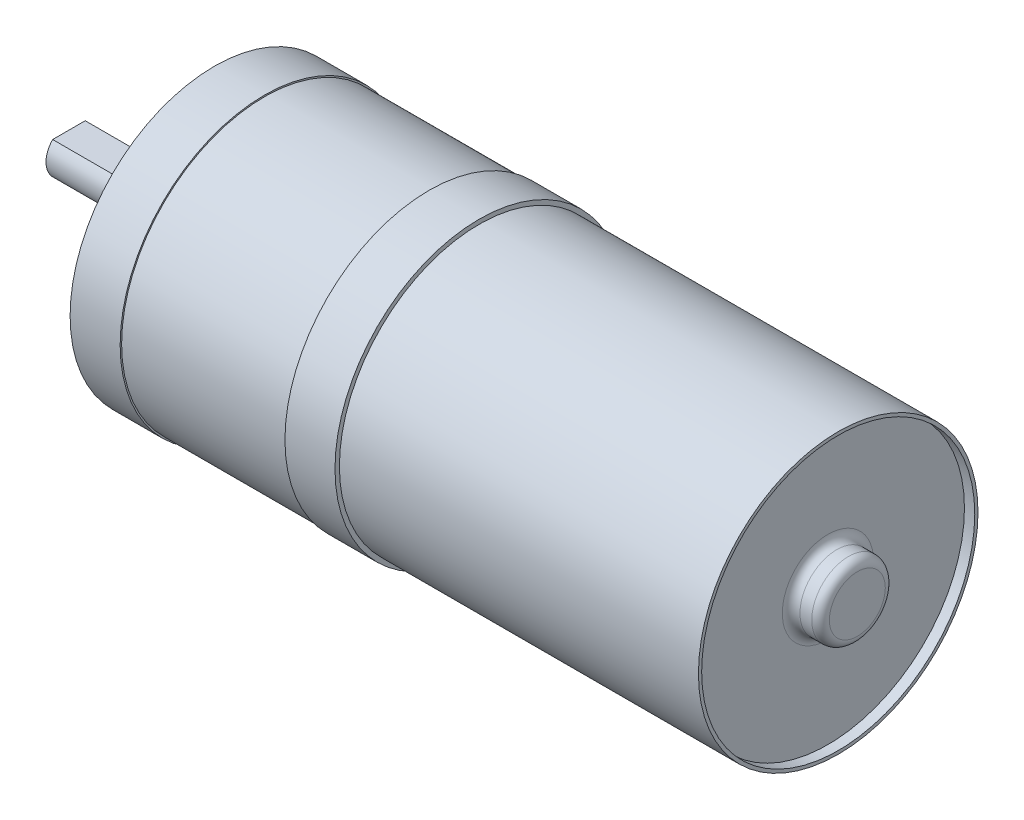
ISO-10303-21;
HEADER;
FILE_DESCRIPTION(('STEP AP214'),'2;1');
FILE_NAME('part.step','',(''),(''),'','','');
FILE_SCHEMA(('AUTOMOTIVE_DESIGN { 1 0 10303 214 1 1 1 1 }'));
ENDSEC;
DATA;
#1=APPLICATION_CONTEXT('core data for automotive mechanical design processes');
#2=APPLICATION_PROTOCOL_DEFINITION('international standard','automotive_design',2000,#1);
#3=PRODUCT_CONTEXT('',#1,'mechanical');
#4=PRODUCT('Part','Part','',(#3));
#5=PRODUCT_RELATED_PRODUCT_CATEGORY('part','',(#4));
#6=PRODUCT_DEFINITION_FORMATION('','',#4);
#7=PRODUCT_DEFINITION_CONTEXT('part definition',#1,'design');
#8=PRODUCT_DEFINITION('design','',#6,#7);
#9=PRODUCT_DEFINITION_SHAPE('','',#8);
#10=(LENGTH_UNIT() NAMED_UNIT(*) SI_UNIT(.MILLI.,.METRE.));
#11=(NAMED_UNIT(*) PLANE_ANGLE_UNIT() SI_UNIT($,.RADIAN.));
#12=(NAMED_UNIT(*) SI_UNIT($,.STERADIAN.) SOLID_ANGLE_UNIT());
#13=UNCERTAINTY_MEASURE_WITH_UNIT(LENGTH_MEASURE(1.E-05),#10,'distance_accuracy_value','');
#14=(GEOMETRIC_REPRESENTATION_CONTEXT(3) GLOBAL_UNCERTAINTY_ASSIGNED_CONTEXT((#13)) GLOBAL_UNIT_ASSIGNED_CONTEXT((#10,
#11,#12)) REPRESENTATION_CONTEXT('',''));
#15=CARTESIAN_POINT('',(0.,0.,0.));
#16=DIRECTION('',(0.,0.,1.));
#17=DIRECTION('',(1.,0.,0.));
#18=AXIS2_PLACEMENT_3D('',#15,#16,#17);
#19=CARTESIAN_POINT('',(30.099,0.,0.));
#20=DIRECTION('',(1.,0.,0.));
#21=DIRECTION('',(0.,0.,-1.));
#22=AXIS2_PLACEMENT_3D('',#19,#20,#21);
#23=PLANE('',#22);
#24=CARTESIAN_POINT('',(30.099,0.,0.));
#25=DIRECTION('',(1.,0.,0.));
#26=DIRECTION('',(0.,0.,-1.));
#27=AXIS2_PLACEMENT_3D('',#24,#25,#26);
#28=CIRCLE('',#27,3.937);
#29=CARTESIAN_POINT('',(30.099,0.,-3.937));
#30=VERTEX_POINT('',#29);
#31=EDGE_CURVE('E42',#30,#30,#28,.F.);
#32=ORIENTED_EDGE('',*,*,#31,.T.);
#33=EDGE_LOOP('',(#32));
#34=FACE_BOUND('',#33,.T.);
#35=CARTESIAN_POINT('',(30.099,0.,0.));
#36=DIRECTION('',(1.,0.,0.));
#37=DIRECTION('',(0.,0.,-1.));
#38=AXIS2_PLACEMENT_3D('',#35,#36,#37);
#39=CIRCLE('',#38,11.7856);
#40=CARTESIAN_POINT('',(30.099,0.,-11.7856));
#41=VERTEX_POINT('',#40);
#42=EDGE_CURVE('E66',#41,#41,#39,.T.);
#43=ORIENTED_EDGE('',*,*,#42,.T.);
#44=EDGE_LOOP('',(#43));
#45=FACE_BOUND('',#44,.T.);
#46=ADVANCED_FACE('F34',(#34,#45),#23,.T.);
#47=CARTESIAN_POINT('',(-25.4,0.,0.));
#48=DIRECTION('',(-1.,0.,0.));
#49=DIRECTION('',(0.,0.,1.));
#50=AXIS2_PLACEMENT_3D('',#47,#48,#49);
#51=PLANE('',#50);
#52=CARTESIAN_POINT('',(-25.4,0.,0.));
#53=DIRECTION('',(-1.,0.,0.));
#54=DIRECTION('',(0.,0.,1.));
#55=AXIS2_PLACEMENT_3D('',#52,#53,#54);
#56=CIRCLE('',#55,3.5052);
#57=CARTESIAN_POINT('',(-25.4,0.,3.5052));
#58=VERTEX_POINT('',#57);
#59=EDGE_CURVE('E79',#58,#58,#56,.T.);
#60=ORIENTED_EDGE('',*,*,#59,.T.);
#61=EDGE_LOOP('',(#60));
#62=FACE_BOUND('',#61,.T.);
#63=CARTESIAN_POINT('',(-25.4,0.,0.));
#64=DIRECTION('',(-1.,0.,0.));
#65=DIRECTION('',(0.,0.,1.));
#66=AXIS2_PLACEMENT_3D('',#63,#64,#65);
#67=CIRCLE('',#66,1.9812);
#68=CARTESIAN_POINT('',(-25.4,0.,1.9812));
#69=VERTEX_POINT('',#68);
#70=EDGE_CURVE('E73',#69,#69,#67,.T.);
#71=ORIENTED_EDGE('',*,*,#70,.F.);
#72=EDGE_LOOP('',(#71));
#73=FACE_BOUND('',#72,.T.);
#74=ADVANCED_FACE('F145',(#62,#73),#51,.T.);
#75=CARTESIAN_POINT('',(-22.86,0.,0.));
#76=DIRECTION('',(-1.,0.,0.));
#77=DIRECTION('',(0.,0.,1.));
#78=AXIS2_PLACEMENT_3D('',#75,#76,#77);
#79=PLANE('',#78);
#80=CARTESIAN_POINT('',(-22.86,0.,-8.509));
#81=DIRECTION('',(-1.,0.,0.));
#82=DIRECTION('',(0.,0.,1.));
#83=AXIS2_PLACEMENT_3D('',#80,#81,#82);
#84=CIRCLE('',#83,1.397);
#85=CARTESIAN_POINT('',(-22.86,0.,-7.112));
#86=VERTEX_POINT('',#85);
#87=EDGE_CURVE('E340',#86,#86,#84,.T.);
#88=ORIENTED_EDGE('',*,*,#87,.F.);
#89=EDGE_LOOP('',(#88));
#90=FACE_BOUND('',#89,.T.);
#91=CARTESIAN_POINT('',(-22.86,0.,8.509));
#92=DIRECTION('',(-1.,0.,0.));
#93=DIRECTION('',(0.,0.,1.));
#94=AXIS2_PLACEMENT_3D('',#91,#92,#93);
#95=CIRCLE('',#94,1.397);
#96=CARTESIAN_POINT('',(-22.86,0.,9.906));
#97=VERTEX_POINT('',#96);
#98=EDGE_CURVE('E339',#97,#97,#95,.T.);
#99=ORIENTED_EDGE('',*,*,#98,.F.);
#100=EDGE_LOOP('',(#99));
#101=FACE_BOUND('',#100,.T.);
#102=CARTESIAN_POINT('',(-22.86,0.,0.));
#103=DIRECTION('',(-1.,0.,0.));
#104=DIRECTION('',(0.,0.,1.));
#105=AXIS2_PLACEMENT_3D('',#102,#103,#104);
#106=CIRCLE('',#105,12.446);
#107=CARTESIAN_POINT('',(-22.86,0.,12.446));
#108=VERTEX_POINT('',#107);
#109=EDGE_CURVE('E88',#108,#108,#106,.T.);
#110=ORIENTED_EDGE('',*,*,#109,.T.);
#111=EDGE_LOOP('',(#110));
#112=FACE_BOUND('',#111,.T.);
#113=CARTESIAN_POINT('',(-22.86,0.,0.));
#114=DIRECTION('',(-1.,0.,0.));
#115=DIRECTION('',(0.,0.,1.));
#116=AXIS2_PLACEMENT_3D('',#113,#114,#115);
#117=CIRCLE('',#116,3.5052);
#118=CARTESIAN_POINT('',(-22.86,0.,3.5052));
#119=VERTEX_POINT('',#118);
#120=EDGE_CURVE('E76',#119,#119,#117,.T.);
#121=ORIENTED_EDGE('',*,*,#120,.F.);
#122=EDGE_LOOP('',(#121));
#123=FACE_BOUND('',#122,.T.);
#124=ADVANCED_FACE('F150',(#90,#101,#112,#123),#79,.T.);
#125=CARTESIAN_POINT('',(-4.318,0.,0.));
#126=DIRECTION('',(-1.,0.,0.));
#127=DIRECTION('',(0.,0.,1.));
#128=AXIS2_PLACEMENT_3D('',#125,#126,#127);
#129=PLANE('',#128);
#130=CARTESIAN_POINT('',(-4.318,0.,0.));
#131=DIRECTION('',(-1.,0.,0.));
#132=DIRECTION('',(0.,0.,1.));
#133=AXIS2_PLACEMENT_3D('',#130,#131,#132);
#134=CIRCLE('',#133,12.446);
#135=CARTESIAN_POINT('',(-4.318,0.,12.446));
#136=VERTEX_POINT('',#135);
#137=EDGE_CURVE('E100',#136,#136,#134,.T.);
#138=ORIENTED_EDGE('',*,*,#137,.T.);
#139=EDGE_LOOP('',(#138));
#140=FACE_BOUND('',#139,.T.);
#141=CARTESIAN_POINT('',(-4.318,0.,0.));
#142=DIRECTION('',(-1.,0.,0.));
#143=DIRECTION('',(0.,0.,1.));
#144=AXIS2_PLACEMENT_3D('',#141,#142,#143);
#145=CIRCLE('',#144,12.319);
#146=CARTESIAN_POINT('',(-4.318,0.,12.319));
#147=VERTEX_POINT('',#146);
#148=EDGE_CURVE('E91',#147,#147,#145,.T.);
#149=ORIENTED_EDGE('',*,*,#148,.F.);
#150=EDGE_LOOP('',(#149));
#151=FACE_BOUND('',#150,.T.);
#152=ADVANCED_FACE('F174',(#140,#151),#129,.T.);
#153=CARTESIAN_POINT('',(30.988,0.,0.));
#154=DIRECTION('',(-1.,0.,0.));
#155=DIRECTION('',(0.,0.,1.));
#156=AXIS2_PLACEMENT_3D('',#153,#154,#155);
#157=CYLINDRICAL_SURFACE('',#156,12.065);
#158=CARTESIAN_POINT('',(30.988,0.,0.));
#159=DIRECTION('',(1.,0.,0.));
#160=DIRECTION('',(0.,0.,-1.));
#161=AXIS2_PLACEMENT_3D('',#158,#159,#160);
#162=CIRCLE('',#161,12.065);
#163=CARTESIAN_POINT('',(30.988,0.,-12.065));
#164=VERTEX_POINT('',#163);
#165=EDGE_CURVE('E108',#164,#164,#162,.T.);
#166=ORIENTED_EDGE('',*,*,#165,.F.);
#167=EDGE_LOOP('',(#166));
#168=FACE_BOUND('',#167,.T.);
#169=CARTESIAN_POINT('',(0.,0.,0.));
#170=DIRECTION('',(-1.,0.,0.));
#171=DIRECTION('',(0.,0.,1.));
#172=AXIS2_PLACEMENT_3D('',#169,#170,#171);
#173=CIRCLE('',#172,12.065);
#174=CARTESIAN_POINT('',(0.,0.,12.065));
#175=VERTEX_POINT('',#174);
#176=EDGE_CURVE('E103',#175,#175,#173,.T.);
#177=ORIENTED_EDGE('',*,*,#176,.F.);
#178=EDGE_LOOP('',(#177));
#179=FACE_BOUND('',#178,.T.);
#180=ADVANCED_FACE('F190',(#168,#179),#157,.T.);
#181=CARTESIAN_POINT('',(30.988,0.,0.));
#182=DIRECTION('',(1.,0.,0.));
#183=DIRECTION('',(0.,0.,-1.));
#184=AXIS2_PLACEMENT_3D('',#181,#182,#183);
#185=PLANE('',#184);
#186=CARTESIAN_POINT('',(30.988,0.,0.));
#187=DIRECTION('',(1.,0.,0.));
#188=DIRECTION('',(0.,0.,-1.));
#189=AXIS2_PLACEMENT_3D('',#186,#187,#188);
#190=CIRCLE('',#189,11.7856);
#191=CARTESIAN_POINT('',(30.988,0.,-11.7856));
#192=VERTEX_POINT('',#191);
#193=EDGE_CURVE('E349',#192,#192,#190,.T.);
#194=ORIENTED_EDGE('',*,*,#193,.F.);
#195=EDGE_LOOP('',(#194));
#196=FACE_BOUND('',#195,.T.);
#197=ORIENTED_EDGE('',*,*,#165,.T.);
#198=EDGE_LOOP('',(#197));
#199=FACE_BOUND('',#198,.T.);
#200=ADVANCED_FACE('F195',(#196,#199),#185,.T.);
#201=CARTESIAN_POINT('',(0.,0.,0.));
#202=DIRECTION('',(-1.,0.,0.));
#203=DIRECTION('',(0.,0.,1.));
#204=AXIS2_PLACEMENT_3D('',#201,#202,#203);
#205=PLANE('',#204);
#206=CARTESIAN_POINT('',(0.,0.,0.));
#207=DIRECTION('',(-1.,0.,0.));
#208=DIRECTION('',(0.,0.,1.));
#209=AXIS2_PLACEMENT_3D('',#206,#207,#208);
#210=CIRCLE('',#209,12.446);
#211=CARTESIAN_POINT('',(0.,0.,12.446));
#212=VERTEX_POINT('',#211);
#213=EDGE_CURVE('E97',#212,#212,#210,.T.);
#214=ORIENTED_EDGE('',*,*,#213,.F.);
#215=EDGE_LOOP('',(#214));
#216=FACE_BOUND('',#215,.T.);
#217=ORIENTED_EDGE('',*,*,#176,.T.);
#218=EDGE_LOOP('',(#217));
#219=FACE_BOUND('',#218,.T.);
#220=ADVANCED_FACE('F192',(#216,#219),#205,.F.);
#221=CARTESIAN_POINT('',(-4.318,0.,0.));
#222=DIRECTION('',(1.,0.,0.));
#223=DIRECTION('',(0.,0.,-1.));
#224=AXIS2_PLACEMENT_3D('',#221,#222,#223);
#225=CYLINDRICAL_SURFACE('',#224,12.446);
#226=ORIENTED_EDGE('',*,*,#137,.F.);
#227=EDGE_LOOP('',(#226));
#228=FACE_BOUND('',#227,.T.);
#229=ORIENTED_EDGE('',*,*,#213,.T.);
#230=EDGE_LOOP('',(#229));
#231=FACE_BOUND('',#230,.T.);
#232=ADVANCED_FACE('F186',(#228,#231),#225,.T.);
#233=CARTESIAN_POINT('',(-18.542,0.,0.));
#234=DIRECTION('',(1.,0.,0.));
#235=DIRECTION('',(0.,0.,-1.));
#236=AXIS2_PLACEMENT_3D('',#233,#234,#235);
#237=CYLINDRICAL_SURFACE('',#236,12.319);
#238=CARTESIAN_POINT('',(-18.542,0.,0.));
#239=DIRECTION('',(-1.,0.,0.));
#240=DIRECTION('',(0.,0.,1.));
#241=AXIS2_PLACEMENT_3D('',#238,#239,#240);
#242=CIRCLE('',#241,12.319);
#243=CARTESIAN_POINT('',(-18.542,0.,12.319));
#244=VERTEX_POINT('',#243);
#245=EDGE_CURVE('E94',#244,#244,#242,.T.);
#246=ORIENTED_EDGE('',*,*,#245,.F.);
#247=EDGE_LOOP('',(#246));
#248=FACE_BOUND('',#247,.T.);
#249=ORIENTED_EDGE('',*,*,#148,.T.);
#250=EDGE_LOOP('',(#249));
#251=FACE_BOUND('',#250,.T.);
#252=ADVANCED_FACE('F179',(#248,#251),#237,.T.);
#253=CARTESIAN_POINT('',(-18.542,0.,0.));
#254=DIRECTION('',(-1.,0.,0.));
#255=DIRECTION('',(0.,0.,1.));
#256=AXIS2_PLACEMENT_3D('',#253,#254,#255);
#257=PLANE('',#256);
#258=CARTESIAN_POINT('',(-18.542,0.,0.));
#259=DIRECTION('',(-1.,0.,0.));
#260=DIRECTION('',(0.,0.,1.));
#261=AXIS2_PLACEMENT_3D('',#258,#259,#260);
#262=CIRCLE('',#261,12.446);
#263=CARTESIAN_POINT('',(-18.542,0.,12.446));
#264=VERTEX_POINT('',#263);
#265=EDGE_CURVE('E86',#264,#264,#262,.T.);
#266=ORIENTED_EDGE('',*,*,#265,.F.);
#267=EDGE_LOOP('',(#266));
#268=FACE_BOUND('',#267,.T.);
#269=ORIENTED_EDGE('',*,*,#245,.T.);
#270=EDGE_LOOP('',(#269));
#271=FACE_BOUND('',#270,.T.);
#272=ADVANCED_FACE('F176',(#268,#271),#257,.F.);
#273=CARTESIAN_POINT('',(-22.86,0.,0.));
#274=DIRECTION('',(1.,0.,0.));
#275=DIRECTION('',(0.,0.,-1.));
#276=AXIS2_PLACEMENT_3D('',#273,#274,#275);
#277=CYLINDRICAL_SURFACE('',#276,12.446);
#278=ORIENTED_EDGE('',*,*,#109,.F.);
#279=EDGE_LOOP('',(#278));
#280=FACE_BOUND('',#279,.T.);
#281=ORIENTED_EDGE('',*,*,#265,.T.);
#282=EDGE_LOOP('',(#281));
#283=FACE_BOUND('',#282,.T.);
#284=ADVANCED_FACE('F170',(#280,#283),#277,.T.);
#285=CARTESIAN_POINT('',(-25.4,0.,0.));
#286=DIRECTION('',(1.,0.,0.));
#287=DIRECTION('',(0.,0.,-1.));
#288=AXIS2_PLACEMENT_3D('',#285,#286,#287);
#289=CYLINDRICAL_SURFACE('',#288,3.5052);
#290=ORIENTED_EDGE('',*,*,#59,.F.);
#291=EDGE_LOOP('',(#290));
#292=FACE_BOUND('',#291,.T.);
#293=ORIENTED_EDGE('',*,*,#120,.T.);
#294=EDGE_LOOP('',(#293));
#295=FACE_BOUND('',#294,.T.);
#296=ADVANCED_FACE('F166',(#292,#295),#289,.T.);
#297=CARTESIAN_POINT('',(-35.4076,0.,0.));
#298=DIRECTION('',(1.,0.,0.));
#299=DIRECTION('',(0.,0.,-1.));
#300=AXIS2_PLACEMENT_3D('',#297,#298,#299);
#301=CYLINDRICAL_SURFACE('',#300,1.9812);
#302=CARTESIAN_POINT('',(-35.4076,0.,0.));
#303=DIRECTION('',(-1.,0.,0.));
#304=DIRECTION('',(0.,0.,1.));
#305=AXIS2_PLACEMENT_3D('',#302,#303,#304);
#306=CIRCLE('',#305,1.9812);
#307=CARTESIAN_POINT('',(-35.4076,1.397,-1.40482897179692));
#308=VERTEX_POINT('',#307);
#309=CARTESIAN_POINT('',(-35.4076,1.397,1.40482897179692));
#310=VERTEX_POINT('',#309);
#311=EDGE_CURVE('E72',#308,#310,#306,.T.);
#312=ORIENTED_EDGE('',*,*,#311,.F.);
#313=DIRECTION('',(-1.,0.,0.));
#314=VECTOR('',#313,1.);
#315=CARTESIAN_POINT('',(-27.4828,1.397,-1.40482897179692));
#316=LINE('',#315,#314);
#317=CARTESIAN_POINT('',(-27.4828,1.397,-1.40482897179692));
#318=VERTEX_POINT('',#317);
#319=EDGE_CURVE('E49',#318,#308,#316,.T.);
#320=ORIENTED_EDGE('',*,*,#319,.F.);
#321=CARTESIAN_POINT('',(-27.4828,0.,0.));
#322=DIRECTION('',(-1.,0.,0.));
#323=DIRECTION('',(0.,0.,1.));
#324=AXIS2_PLACEMENT_3D('',#321,#322,#323);
#325=CIRCLE('',#324,1.9812);
#326=CARTESIAN_POINT('',(-27.4828,1.397,1.40482897179692));
#327=VERTEX_POINT('',#326);
#328=EDGE_CURVE('E65',#327,#318,#325,.T.);
#329=ORIENTED_EDGE('',*,*,#328,.F.);
#330=DIRECTION('',(-1.,0.,0.));
#331=VECTOR('',#330,1.);
#332=CARTESIAN_POINT('',(-27.4828,1.397,1.40482897179692));
#333=LINE('',#332,#331);
#334=EDGE_CURVE('E55',#327,#310,#333,.T.);
#335=ORIENTED_EDGE('',*,*,#334,.T.);
#336=EDGE_LOOP('',(#312,#320,#329,#335));
#337=FACE_BOUND('',#336,.T.);
#338=ORIENTED_EDGE('',*,*,#70,.T.);
#339=EDGE_LOOP('',(#338));
#340=FACE_BOUND('',#339,.T.);
#341=ADVANCED_FACE('F70',(#337,#340),#301,.T.);
#342=CARTESIAN_POINT('',(-35.4076,0.,0.));
#343=DIRECTION('',(-1.,0.,0.));
#344=DIRECTION('',(0.,0.,1.));
#345=AXIS2_PLACEMENT_3D('',#342,#343,#344);
#346=PLANE('',#345);
#347=DIRECTION('',(0.,0.,1.));
#348=VECTOR('',#347,1.);
#349=CARTESIAN_POINT('',(-35.4076,1.397,-1.40482897179692));
#350=LINE('',#349,#348);
#351=EDGE_CURVE('E60',#308,#310,#350,.T.);
#352=ORIENTED_EDGE('',*,*,#351,.F.);
#353=ORIENTED_EDGE('',*,*,#311,.T.);
#354=EDGE_LOOP('',(#352,#353));
#355=FACE_BOUND('',#354,.T.);
#356=ADVANCED_FACE('F75',(#355),#346,.T.);
#357=CARTESIAN_POINT('',(-27.4828,1.397,-1.40482897179692));
#358=DIRECTION('',(0.,-1.,0.));
#359=DIRECTION('',(0.,0.,-1.));
#360=AXIS2_PLACEMENT_3D('',#357,#358,#359);
#361=PLANE('',#360);
#362=ORIENTED_EDGE('',*,*,#351,.T.);
#363=ORIENTED_EDGE('',*,*,#334,.F.);
#364=DIRECTION('',(0.,0.,1.));
#365=VECTOR('',#364,1.);
#366=CARTESIAN_POINT('',(-27.4828,1.397,-1.40482897179692));
#367=LINE('',#366,#365);
#368=EDGE_CURVE('E356',#318,#327,#367,.T.);
#369=ORIENTED_EDGE('',*,*,#368,.F.);
#370=ORIENTED_EDGE('',*,*,#319,.T.);
#371=EDGE_LOOP('',(#362,#363,#369,#370));
#372=FACE_BOUND('',#371,.T.);
#373=ADVANCED_FACE('F61',(#372),#361,.F.);
#374=CARTESIAN_POINT('',(-27.4828,0.,0.));
#375=DIRECTION('',(-1.,0.,0.));
#376=DIRECTION('',(0.,0.,1.));
#377=AXIS2_PLACEMENT_3D('',#374,#375,#376);
#378=PLANE('',#377);
#379=ORIENTED_EDGE('',*,*,#328,.T.);
#380=ORIENTED_EDGE('',*,*,#368,.T.);
#381=EDGE_LOOP('',(#379,#380));
#382=FACE_BOUND('',#381,.T.);
#383=ADVANCED_FACE('F156',(#382),#378,.T.);
#384=CARTESIAN_POINT('',(30.099,0.,0.));
#385=DIRECTION('',(1.,0.,0.));
#386=DIRECTION('',(0.,0.,-1.));
#387=AXIS2_PLACEMENT_3D('',#384,#385,#386);
#388=CYLINDRICAL_SURFACE('',#387,11.7856);
#389=ORIENTED_EDGE('',*,*,#42,.F.);
#390=EDGE_LOOP('',(#389));
#391=FACE_BOUND('',#390,.T.);
#392=ORIENTED_EDGE('',*,*,#193,.T.);
#393=EDGE_LOOP('',(#392));
#394=FACE_BOUND('',#393,.T.);
#395=ADVANCED_FACE('F130',(#391,#394),#388,.F.);
#396=CARTESIAN_POINT('',(32.639,0.,0.));
#397=DIRECTION('',(-1.,0.,0.));
#398=DIRECTION('',(0.,0.,1.));
#399=AXIS2_PLACEMENT_3D('',#396,#397,#398);
#400=CYLINDRICAL_SURFACE('',#399,3.175);
#401=CARTESIAN_POINT('',(30.861,0.,0.));
#402=DIRECTION('',(1.,0.,0.));
#403=DIRECTION('',(0.,0.,-1.));
#404=AXIS2_PLACEMENT_3D('',#401,#402,#403);
#405=CIRCLE('',#404,3.175);
#406=CARTESIAN_POINT('',(30.861,0.,-3.175));
#407=VERTEX_POINT('',#406);
#408=EDGE_CURVE('E114',#407,#407,#405,.T.);
#409=ORIENTED_EDGE('',*,*,#408,.T.);
#410=EDGE_LOOP('',(#409));
#411=FACE_BOUND('',#410,.T.);
#412=CARTESIAN_POINT('',(31.877,0.,0.));
#413=DIRECTION('',(1.,0.,0.));
#414=DIRECTION('',(0.,0.,-1.));
#415=AXIS2_PLACEMENT_3D('',#412,#413,#414);
#416=CIRCLE('',#415,3.175);
#417=CARTESIAN_POINT('',(31.877,0.,-3.175));
#418=VERTEX_POINT('',#417);
#419=EDGE_CURVE('E111',#418,#418,#416,.F.);
#420=ORIENTED_EDGE('',*,*,#419,.T.);
#421=EDGE_LOOP('',(#420));
#422=FACE_BOUND('',#421,.T.);
#423=ADVANCED_FACE('F127',(#411,#422),#400,.T.);
#424=CARTESIAN_POINT('',(32.639,0.,0.));
#425=DIRECTION('',(1.,0.,0.));
#426=DIRECTION('',(0.,0.,-1.));
#427=AXIS2_PLACEMENT_3D('',#424,#425,#426);
#428=PLANE('',#427);
#429=CARTESIAN_POINT('',(32.639,0.,0.));
#430=DIRECTION('',(1.,0.,0.));
#431=DIRECTION('',(0.,0.,-1.));
#432=AXIS2_PLACEMENT_3D('',#429,#430,#431);
#433=CIRCLE('',#432,2.413);
#434=CARTESIAN_POINT('',(32.639,0.,-2.413));
#435=VERTEX_POINT('',#434);
#436=EDGE_CURVE('E11',#435,#435,#433,.T.);
#437=ORIENTED_EDGE('',*,*,#436,.T.);
#438=EDGE_LOOP('',(#437));
#439=FACE_BOUND('',#438,.T.);
#440=ADVANCED_FACE('F124',(#439),#428,.T.);
#441=CARTESIAN_POINT('',(30.861,0.,0.));
#442=DIRECTION('',(1.,0.,0.));
#443=DIRECTION('',(0.,0.,-1.));
#444=AXIS2_PLACEMENT_3D('',#441,#442,#443);
#445=TOROIDAL_SURFACE('',#444,3.937,0.762);
#446=ORIENTED_EDGE('',*,*,#31,.F.);
#447=EDGE_LOOP('',(#446));
#448=FACE_BOUND('',#447,.T.);
#449=ORIENTED_EDGE('',*,*,#408,.F.);
#450=EDGE_LOOP('',(#449));
#451=FACE_BOUND('',#450,.T.);
#452=ADVANCED_FACE('F121',(#448,#451),#445,.F.);
#453=CARTESIAN_POINT('',(31.877,0.,0.));
#454=DIRECTION('',(1.,0.,0.));
#455=DIRECTION('',(0.,0.,-1.));
#456=AXIS2_PLACEMENT_3D('',#453,#454,#455);
#457=TOROIDAL_SURFACE('',#456,2.413,0.762);
#458=ORIENTED_EDGE('',*,*,#419,.F.);
#459=EDGE_LOOP('',(#458));
#460=FACE_BOUND('',#459,.T.);
#461=ORIENTED_EDGE('',*,*,#436,.F.);
#462=EDGE_LOOP('',(#461));
#463=FACE_BOUND('',#462,.T.);
#464=ADVANCED_FACE('F36',(#460,#463),#457,.T.);
#465=CARTESIAN_POINT('',(-18.1102,0.,8.509));
#466=DIRECTION('',(-1.,0.,0.));
#467=DIRECTION('',(0.,0.,1.));
#468=AXIS2_PLACEMENT_3D('',#465,#466,#467);
#469=CYLINDRICAL_SURFACE('',#468,1.397);
#470=CARTESIAN_POINT('',(-18.1102,0.,8.509));
#471=DIRECTION('',(-1.,0.,0.));
#472=DIRECTION('',(0.,0.,1.));
#473=AXIS2_PLACEMENT_3D('',#470,#471,#472);
#474=CIRCLE('',#473,1.397);
#475=CARTESIAN_POINT('',(-18.1102,0.,9.906));
#476=VERTEX_POINT('',#475);
#477=EDGE_CURVE('E343',#476,#476,#474,.T.);
#478=ORIENTED_EDGE('',*,*,#477,.F.);
#479=EDGE_LOOP('',(#478));
#480=FACE_BOUND('',#479,.T.);
#481=ORIENTED_EDGE('',*,*,#98,.T.);
#482=EDGE_LOOP('',(#481));
#483=FACE_BOUND('',#482,.T.);
#484=ADVANCED_FACE('F136',(#480,#483),#469,.F.);
#485=CARTESIAN_POINT('',(-18.1102,0.,8.509));
#486=DIRECTION('',(-1.,0.,0.));
#487=DIRECTION('',(0.,0.,1.));
#488=AXIS2_PLACEMENT_3D('',#485,#486,#487);
#489=PLANE('',#488);
#490=ORIENTED_EDGE('',*,*,#477,.T.);
#491=EDGE_LOOP('',(#490));
#492=FACE_BOUND('',#491,.T.);
#493=ADVANCED_FACE('F301',(#492),#489,.T.);
#494=CARTESIAN_POINT('',(-18.1102,0.,-8.509));
#495=DIRECTION('',(-1.,0.,0.));
#496=DIRECTION('',(0.,0.,1.));
#497=AXIS2_PLACEMENT_3D('',#494,#495,#496);
#498=CYLINDRICAL_SURFACE('',#497,1.397);
#499=CARTESIAN_POINT('',(-18.1102,0.,-8.509));
#500=DIRECTION('',(-1.,0.,0.));
#501=DIRECTION('',(0.,0.,1.));
#502=AXIS2_PLACEMENT_3D('',#499,#500,#501);
#503=CIRCLE('',#502,1.397);
#504=CARTESIAN_POINT('',(-18.1102,0.,-7.112));
#505=VERTEX_POINT('',#504);
#506=EDGE_CURVE('E338',#505,#505,#503,.T.);
#507=ORIENTED_EDGE('',*,*,#506,.F.);
#508=EDGE_LOOP('',(#507));
#509=FACE_BOUND('',#508,.T.);
#510=ORIENTED_EDGE('',*,*,#87,.T.);
#511=EDGE_LOOP('',(#510));
#512=FACE_BOUND('',#511,.T.);
#513=ADVANCED_FACE('F311',(#509,#512),#498,.F.);
#514=CARTESIAN_POINT('',(-18.1102,0.,-8.509));
#515=DIRECTION('',(-1.,0.,0.));
#516=DIRECTION('',(0.,0.,1.));
#517=AXIS2_PLACEMENT_3D('',#514,#515,#516);
#518=PLANE('',#517);
#519=ORIENTED_EDGE('',*,*,#506,.T.);
#520=EDGE_LOOP('',(#519));
#521=FACE_BOUND('',#520,.T.);
#522=ADVANCED_FACE('F321',(#521),#518,.T.);
#523=CLOSED_SHELL('',(#46,#74,#124,#152,#180,#200,#220,#232,#252,#272,#284,#296,#341,#356,#373,
#383,#395,#423,#440,#452,#464,#484,#493,#513,#522));
#524=MANIFOLD_SOLID_BREP('B2',#523);
#525=ADVANCED_BREP_SHAPE_REPRESENTATION('',(#18,#524),#14);
#526=SHAPE_DEFINITION_REPRESENTATION(#9,#525);
ENDSEC;
END-ISO-10303-21;
